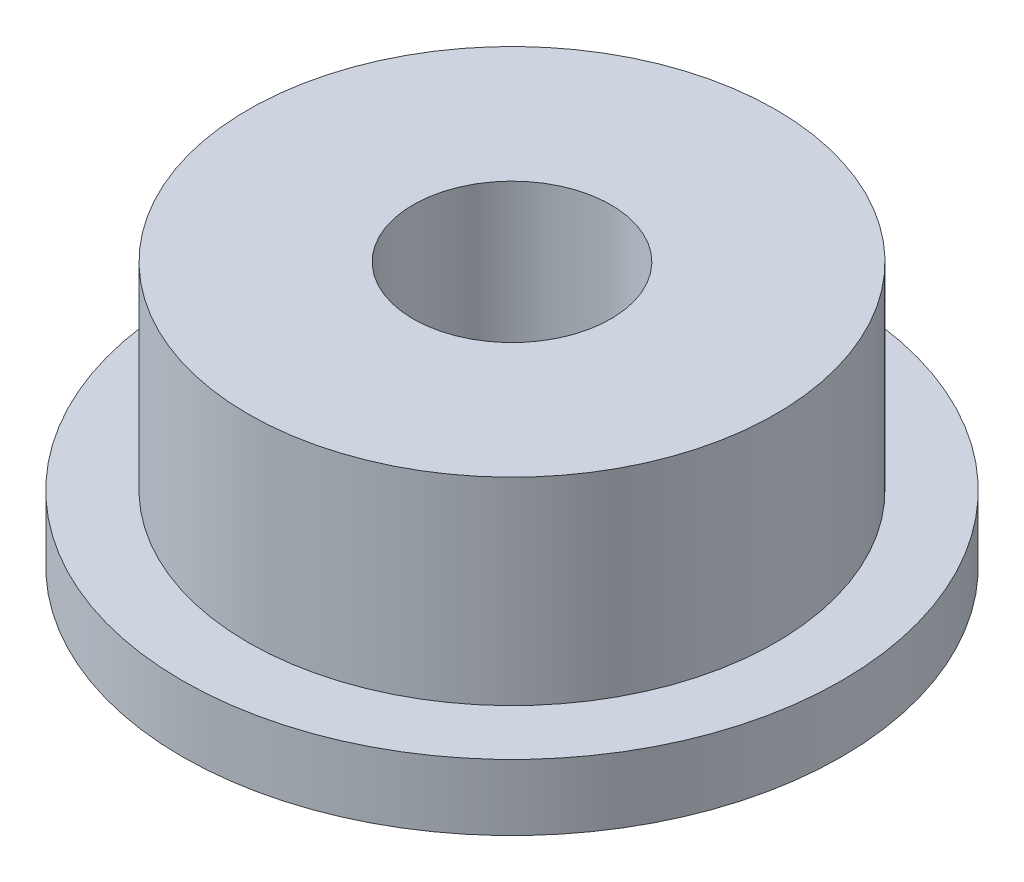
ISO-10303-21;
HEADER;
FILE_DESCRIPTION(('STEP AP214'),'2;1');
FILE_NAME('part.step','',(''),(''),'','','');
FILE_SCHEMA(('AUTOMOTIVE_DESIGN { 1 0 10303 214 1 1 1 1 }'));
ENDSEC;
DATA;
#1=APPLICATION_CONTEXT('core data for automotive mechanical design processes');
#2=APPLICATION_PROTOCOL_DEFINITION('international standard','automotive_design',2000,#1);
#3=PRODUCT_CONTEXT('',#1,'mechanical');
#4=PRODUCT('Part','Part','',(#3));
#5=PRODUCT_RELATED_PRODUCT_CATEGORY('part','',(#4));
#6=PRODUCT_DEFINITION_FORMATION('','',#4);
#7=PRODUCT_DEFINITION_CONTEXT('part definition',#1,'design');
#8=PRODUCT_DEFINITION('design','',#6,#7);
#9=PRODUCT_DEFINITION_SHAPE('','',#8);
#10=(LENGTH_UNIT() NAMED_UNIT(*) SI_UNIT(.MILLI.,.METRE.));
#11=(NAMED_UNIT(*) PLANE_ANGLE_UNIT() SI_UNIT($,.RADIAN.));
#12=(NAMED_UNIT(*) SI_UNIT($,.STERADIAN.) SOLID_ANGLE_UNIT());
#13=UNCERTAINTY_MEASURE_WITH_UNIT(LENGTH_MEASURE(1.E-05),#10,'distance_accuracy_value','');
#14=(GEOMETRIC_REPRESENTATION_CONTEXT(3) GLOBAL_UNCERTAINTY_ASSIGNED_CONTEXT((#13)) GLOBAL_UNIT_ASSIGNED_CONTEXT((#10,
#11,#12)) REPRESENTATION_CONTEXT('',''));
#15=CARTESIAN_POINT('',(0.,0.,0.));
#16=DIRECTION('',(0.,0.,1.));
#17=DIRECTION('',(1.,0.,0.));
#18=AXIS2_PLACEMENT_3D('',#15,#16,#17);
#19=CARTESIAN_POINT('',(0.,0.,0.));
#20=DIRECTION('',(0.,1.,0.));
#21=DIRECTION('',(0.,0.,1.));
#22=AXIS2_PLACEMENT_3D('',#19,#20,#21);
#23=CYLINDRICAL_SURFACE('',#22,4.);
#24=CARTESIAN_POINT('',(0.,0.,0.));
#25=DIRECTION('',(0.,1.,0.));
#26=DIRECTION('',(0.,0.,1.));
#27=AXIS2_PLACEMENT_3D('',#24,#25,#26);
#28=CIRCLE('',#27,4.);
#29=CARTESIAN_POINT('',(0.,0.,4.));
#30=VERTEX_POINT('',#29);
#31=EDGE_CURVE('E39',#30,#30,#28,.F.);
#32=ORIENTED_EDGE('',*,*,#31,.T.);
#33=EDGE_LOOP('',(#32));
#34=FACE_BOUND('',#33,.T.);
#35=CARTESIAN_POINT('',(0.,-3.,0.));
#36=DIRECTION('',(0.,1.,0.));
#37=DIRECTION('',(0.,0.,1.));
#38=AXIS2_PLACEMENT_3D('',#35,#36,#37);
#39=CIRCLE('',#38,4.);
#40=CARTESIAN_POINT('',(0.,-3.,4.));
#41=VERTEX_POINT('',#40);
#42=EDGE_CURVE('E18',#41,#41,#39,.T.);
#43=ORIENTED_EDGE('',*,*,#42,.T.);
#44=EDGE_LOOP('',(#43));
#45=FACE_BOUND('',#44,.T.);
#46=ADVANCED_FACE('F15',(#34,#45),#23,.T.);
#47=CARTESIAN_POINT('',(4.,-3.,0.));
#48=DIRECTION('',(0.,-1.,0.));
#49=DIRECTION('',(0.,0.,-1.));
#50=AXIS2_PLACEMENT_3D('',#47,#48,#49);
#51=PLANE('',#50);
#52=CARTESIAN_POINT('',(0.,-3.,0.));
#53=DIRECTION('',(0.,1.,0.));
#54=DIRECTION('',(0.,0.,1.));
#55=AXIS2_PLACEMENT_3D('',#52,#53,#54);
#56=CIRCLE('',#55,5.);
#57=CARTESIAN_POINT('',(0.,-3.,5.));
#58=VERTEX_POINT('',#57);
#59=EDGE_CURVE('E36',#58,#58,#56,.F.);
#60=ORIENTED_EDGE('',*,*,#59,.F.);
#61=EDGE_LOOP('',(#60));
#62=FACE_BOUND('',#61,.T.);
#63=ORIENTED_EDGE('',*,*,#42,.F.);
#64=EDGE_LOOP('',(#63));
#65=FACE_BOUND('',#64,.T.);
#66=ADVANCED_FACE('F49',(#62,#65),#51,.F.);
#67=CARTESIAN_POINT('',(1.5,0.,0.));
#68=DIRECTION('',(0.,-1.,0.));
#69=DIRECTION('',(0.,0.,-1.));
#70=AXIS2_PLACEMENT_3D('',#67,#68,#69);
#71=PLANE('',#70);
#72=ORIENTED_EDGE('',*,*,#31,.F.);
#73=EDGE_LOOP('',(#72));
#74=FACE_BOUND('',#73,.T.);
#75=CARTESIAN_POINT('',(0.,0.,0.));
#76=DIRECTION('',(0.,1.,0.));
#77=DIRECTION('',(0.,0.,1.));
#78=AXIS2_PLACEMENT_3D('',#75,#76,#77);
#79=CIRCLE('',#78,1.5);
#80=CARTESIAN_POINT('',(0.,0.,1.5));
#81=VERTEX_POINT('',#80);
#82=EDGE_CURVE('E30',#81,#81,#79,.F.);
#83=ORIENTED_EDGE('',*,*,#82,.T.);
#84=EDGE_LOOP('',(#83));
#85=FACE_BOUND('',#84,.T.);
#86=ADVANCED_FACE('F51',(#74,#85),#71,.F.);
#87=CARTESIAN_POINT('',(0.,0.,0.));
#88=DIRECTION('',(0.,1.,0.));
#89=DIRECTION('',(0.,0.,1.));
#90=AXIS2_PLACEMENT_3D('',#87,#88,#89);
#91=CYLINDRICAL_SURFACE('',#90,5.);
#92=ORIENTED_EDGE('',*,*,#59,.T.);
#93=EDGE_LOOP('',(#92));
#94=FACE_BOUND('',#93,.T.);
#95=CARTESIAN_POINT('',(0.,-4.,0.));
#96=DIRECTION('',(0.,1.,0.));
#97=DIRECTION('',(0.,0.,1.));
#98=AXIS2_PLACEMENT_3D('',#95,#96,#97);
#99=CIRCLE('',#98,5.);
#100=CARTESIAN_POINT('',(0.,-4.,5.));
#101=VERTEX_POINT('',#100);
#102=EDGE_CURVE('E23',#101,#101,#99,.T.);
#103=ORIENTED_EDGE('',*,*,#102,.T.);
#104=EDGE_LOOP('',(#103));
#105=FACE_BOUND('',#104,.T.);
#106=ADVANCED_FACE('F58',(#94,#105),#91,.T.);
#107=CARTESIAN_POINT('',(0.,0.,0.));
#108=DIRECTION('',(0.,1.,0.));
#109=DIRECTION('',(0.,0.,1.));
#110=AXIS2_PLACEMENT_3D('',#107,#108,#109);
#111=CYLINDRICAL_SURFACE('',#110,1.5);
#112=CARTESIAN_POINT('',(0.,-4.,0.));
#113=DIRECTION('',(0.,1.,0.));
#114=DIRECTION('',(0.,0.,1.));
#115=AXIS2_PLACEMENT_3D('',#112,#113,#114);
#116=CIRCLE('',#115,1.5);
#117=CARTESIAN_POINT('',(0.,-4.,1.5));
#118=VERTEX_POINT('',#117);
#119=EDGE_CURVE('E10',#118,#118,#116,.F.);
#120=ORIENTED_EDGE('',*,*,#119,.T.);
#121=EDGE_LOOP('',(#120));
#122=FACE_BOUND('',#121,.T.);
#123=ORIENTED_EDGE('',*,*,#82,.F.);
#124=EDGE_LOOP('',(#123));
#125=FACE_BOUND('',#124,.T.);
#126=ADVANCED_FACE('F64',(#122,#125),#111,.F.);
#127=CARTESIAN_POINT('',(5.,-4.,0.));
#128=DIRECTION('',(0.,1.,0.));
#129=DIRECTION('',(0.,0.,1.));
#130=AXIS2_PLACEMENT_3D('',#127,#128,#129);
#131=PLANE('',#130);
#132=ORIENTED_EDGE('',*,*,#119,.F.);
#133=EDGE_LOOP('',(#132));
#134=FACE_BOUND('',#133,.T.);
#135=ORIENTED_EDGE('',*,*,#102,.F.);
#136=EDGE_LOOP('',(#135));
#137=FACE_BOUND('',#136,.T.);
#138=ADVANCED_FACE('F62',(#134,#137),#131,.F.);
#139=CLOSED_SHELL('',(#46,#66,#86,#106,#126,#138));
#140=MANIFOLD_SOLID_BREP('B1',#139);
#141=ADVANCED_BREP_SHAPE_REPRESENTATION('',(#18,#140),#14);
#142=SHAPE_DEFINITION_REPRESENTATION(#9,#141);
ENDSEC;
END-ISO-10303-21;
